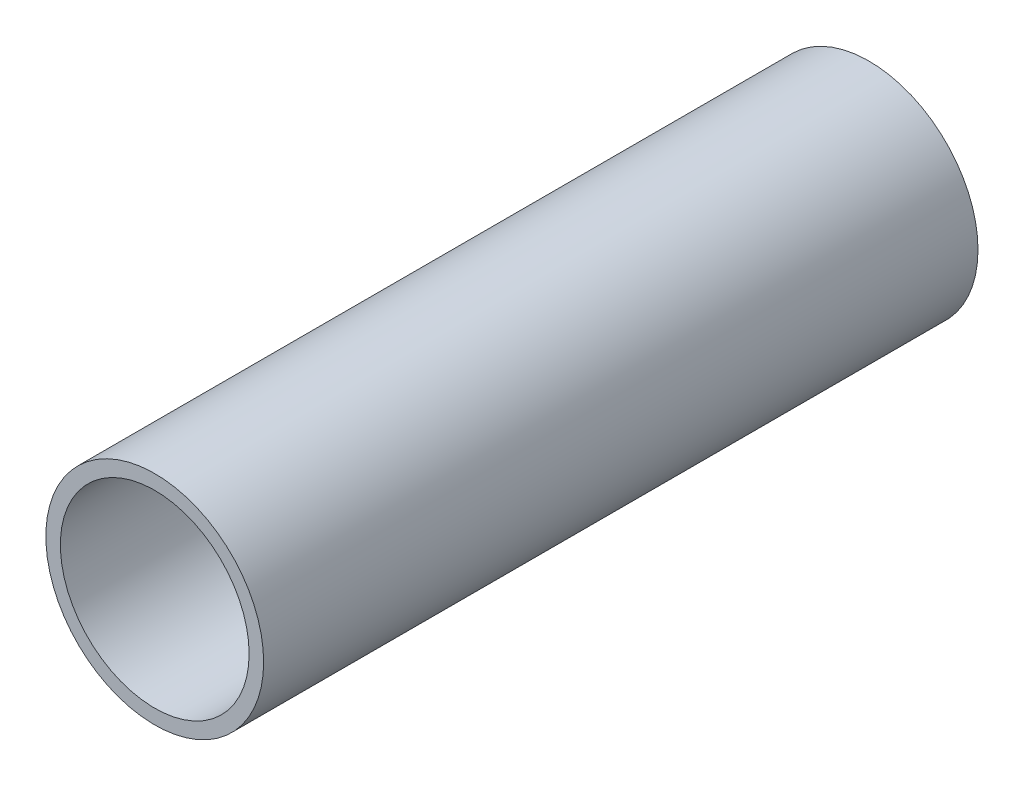
ISO-10303-21;
HEADER;
FILE_DESCRIPTION(('STEP AP214'),'2;1');
FILE_NAME('part.step','',(''),(''),'','','');
FILE_SCHEMA(('AUTOMOTIVE_DESIGN { 1 0 10303 214 1 1 1 1 }'));
ENDSEC;
DATA;
#1=APPLICATION_CONTEXT('core data for automotive mechanical design processes');
#2=APPLICATION_PROTOCOL_DEFINITION('international standard','automotive_design',2000,#1);
#3=PRODUCT_CONTEXT('',#1,'mechanical');
#4=PRODUCT('Part','Part','',(#3));
#5=PRODUCT_RELATED_PRODUCT_CATEGORY('part','',(#4));
#6=PRODUCT_DEFINITION_FORMATION('','',#4);
#7=PRODUCT_DEFINITION_CONTEXT('part definition',#1,'design');
#8=PRODUCT_DEFINITION('design','',#6,#7);
#9=PRODUCT_DEFINITION_SHAPE('','',#8);
#10=(LENGTH_UNIT() NAMED_UNIT(*) SI_UNIT(.MILLI.,.METRE.));
#11=(NAMED_UNIT(*) PLANE_ANGLE_UNIT() SI_UNIT($,.RADIAN.));
#12=(NAMED_UNIT(*) SI_UNIT($,.STERADIAN.) SOLID_ANGLE_UNIT());
#13=UNCERTAINTY_MEASURE_WITH_UNIT(LENGTH_MEASURE(1.E-05),#10,'distance_accuracy_value','');
#14=(GEOMETRIC_REPRESENTATION_CONTEXT(3) GLOBAL_UNCERTAINTY_ASSIGNED_CONTEXT((#13)) GLOBAL_UNIT_ASSIGNED_CONTEXT((#10,
#11,#12)) REPRESENTATION_CONTEXT('',''));
#15=CARTESIAN_POINT('',(0.,0.,0.));
#16=DIRECTION('',(0.,0.,1.));
#17=DIRECTION('',(1.,0.,0.));
#18=AXIS2_PLACEMENT_3D('',#15,#16,#17);
#19=CARTESIAN_POINT('',(0.,0.,62.484));
#20=DIRECTION('',(0.,0.,1.));
#21=DIRECTION('',(1.,0.,0.));
#22=AXIS2_PLACEMENT_3D('',#19,#20,#21);
#23=PLANE('',#22);
#24=CARTESIAN_POINT('',(0.,0.,62.484));
#25=DIRECTION('',(0.,0.,1.));
#26=DIRECTION('',(1.,0.,0.));
#27=AXIS2_PLACEMENT_3D('',#24,#25,#26);
#28=CIRCLE('',#27,9.525);
#29=CARTESIAN_POINT('',(9.525,0.,62.484));
#30=VERTEX_POINT('',#29);
#31=EDGE_CURVE('E10',#30,#30,#28,.T.);
#32=ORIENTED_EDGE('',*,*,#31,.T.);
#33=EDGE_LOOP('',(#32));
#34=FACE_BOUND('',#33,.T.);
#35=CARTESIAN_POINT('',(0.,0.,62.484));
#36=DIRECTION('',(0.,0.,1.));
#37=DIRECTION('',(1.,0.,0.));
#38=AXIS2_PLACEMENT_3D('',#35,#36,#37);
#39=CIRCLE('',#38,8.255);
#40=CARTESIAN_POINT('',(8.255,0.,62.484));
#41=VERTEX_POINT('',#40);
#42=EDGE_CURVE('E42',#41,#41,#39,.T.);
#43=ORIENTED_EDGE('',*,*,#42,.F.);
#44=EDGE_LOOP('',(#43));
#45=FACE_BOUND('',#44,.T.);
#46=ADVANCED_FACE('F31',(#34,#45),#23,.T.);
#47=CARTESIAN_POINT('',(0.,0.,0.));
#48=DIRECTION('',(0.,0.,1.));
#49=DIRECTION('',(1.,0.,0.));
#50=AXIS2_PLACEMENT_3D('',#47,#48,#49);
#51=PLANE('',#50);
#52=CARTESIAN_POINT('',(0.,0.,0.));
#53=DIRECTION('',(0.,0.,1.));
#54=DIRECTION('',(1.,0.,0.));
#55=AXIS2_PLACEMENT_3D('',#52,#53,#54);
#56=CIRCLE('',#55,9.525);
#57=CARTESIAN_POINT('',(9.525,0.,0.));
#58=VERTEX_POINT('',#57);
#59=EDGE_CURVE('E35',#58,#58,#56,.T.);
#60=ORIENTED_EDGE('',*,*,#59,.F.);
#61=EDGE_LOOP('',(#60));
#62=FACE_BOUND('',#61,.T.);
#63=CARTESIAN_POINT('',(0.,0.,0.));
#64=DIRECTION('',(0.,0.,1.));
#65=DIRECTION('',(1.,0.,0.));
#66=AXIS2_PLACEMENT_3D('',#63,#64,#65);
#67=CIRCLE('',#66,8.255);
#68=CARTESIAN_POINT('',(8.255,0.,0.));
#69=VERTEX_POINT('',#68);
#70=EDGE_CURVE('E44',#69,#69,#67,.T.);
#71=ORIENTED_EDGE('',*,*,#70,.T.);
#72=EDGE_LOOP('',(#71));
#73=FACE_BOUND('',#72,.T.);
#74=ADVANCED_FACE('F54',(#62,#73),#51,.F.);
#75=CARTESIAN_POINT('',(0.,0.,62.484));
#76=DIRECTION('',(0.,0.,-1.));
#77=DIRECTION('',(-1.,0.,0.));
#78=AXIS2_PLACEMENT_3D('',#75,#76,#77);
#79=CYLINDRICAL_SURFACE('',#78,9.525);
#80=ORIENTED_EDGE('',*,*,#31,.F.);
#81=EDGE_LOOP('',(#80));
#82=FACE_BOUND('',#81,.T.);
#83=ORIENTED_EDGE('',*,*,#59,.T.);
#84=EDGE_LOOP('',(#83));
#85=FACE_BOUND('',#84,.T.);
#86=ADVANCED_FACE('F33',(#82,#85),#79,.T.);
#87=CARTESIAN_POINT('',(0.,0.,62.484));
#88=DIRECTION('',(0.,0.,-1.));
#89=DIRECTION('',(-1.,0.,0.));
#90=AXIS2_PLACEMENT_3D('',#87,#88,#89);
#91=CYLINDRICAL_SURFACE('',#90,8.255);
#92=ORIENTED_EDGE('',*,*,#42,.T.);
#93=EDGE_LOOP('',(#92));
#94=FACE_BOUND('',#93,.T.);
#95=ORIENTED_EDGE('',*,*,#70,.F.);
#96=EDGE_LOOP('',(#95));
#97=FACE_BOUND('',#96,.T.);
#98=ADVANCED_FACE('F50',(#94,#97),#91,.F.);
#99=CLOSED_SHELL('',(#46,#74,#86,#98));
#100=MANIFOLD_SOLID_BREP('B2',#99);
#101=ADVANCED_BREP_SHAPE_REPRESENTATION('',(#18,#100),#14);
#102=SHAPE_DEFINITION_REPRESENTATION(#9,#101);
ENDSEC;
END-ISO-10303-21;
